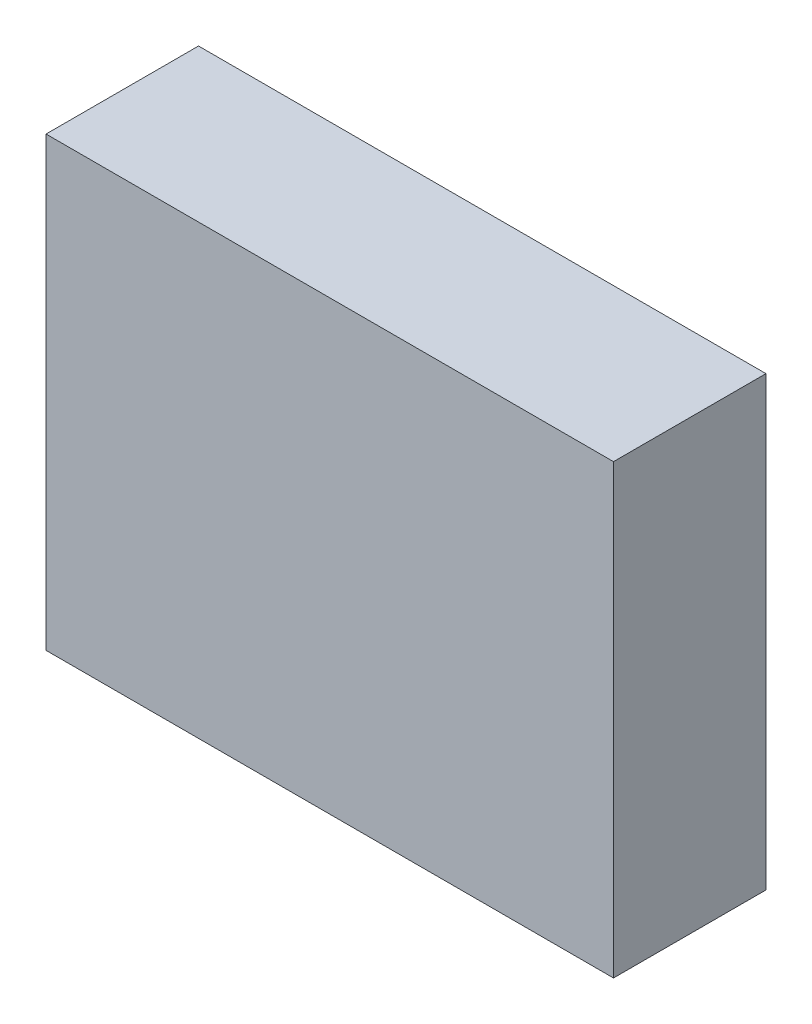
ISO-10303-21;
HEADER;
FILE_DESCRIPTION(('STEP AP214'),'2;1');
FILE_NAME('part.step','',(''),(''),'','','');
FILE_SCHEMA(('AUTOMOTIVE_DESIGN { 1 0 10303 214 1 1 1 1 }'));
ENDSEC;
DATA;
#1=APPLICATION_CONTEXT('core data for automotive mechanical design processes');
#2=APPLICATION_PROTOCOL_DEFINITION('international standard','automotive_design',2000,#1);
#3=PRODUCT_CONTEXT('',#1,'mechanical');
#4=PRODUCT('Part','Part','',(#3));
#5=PRODUCT_RELATED_PRODUCT_CATEGORY('part','',(#4));
#6=PRODUCT_DEFINITION_FORMATION('','',#4);
#7=PRODUCT_DEFINITION_CONTEXT('part definition',#1,'design');
#8=PRODUCT_DEFINITION('design','',#6,#7);
#9=PRODUCT_DEFINITION_SHAPE('','',#8);
#10=(LENGTH_UNIT() NAMED_UNIT(*) SI_UNIT(.MILLI.,.METRE.));
#11=(NAMED_UNIT(*) PLANE_ANGLE_UNIT() SI_UNIT($,.RADIAN.));
#12=(NAMED_UNIT(*) SI_UNIT($,.STERADIAN.) SOLID_ANGLE_UNIT());
#13=UNCERTAINTY_MEASURE_WITH_UNIT(LENGTH_MEASURE(1.E-05),#10,'distance_accuracy_value','');
#14=(GEOMETRIC_REPRESENTATION_CONTEXT(3) GLOBAL_UNCERTAINTY_ASSIGNED_CONTEXT((#13)) GLOBAL_UNIT_ASSIGNED_CONTEXT((#10,
#11,#12)) REPRESENTATION_CONTEXT('',''));
#15=CARTESIAN_POINT('',(0.,0.,0.));
#16=DIRECTION('',(0.,0.,1.));
#17=DIRECTION('',(1.,0.,0.));
#18=AXIS2_PLACEMENT_3D('',#15,#16,#17);
#19=CARTESIAN_POINT('',(1.67500046,1.3199999,0.90000074));
#20=DIRECTION('',(0.,0.,-1.));
#21=DIRECTION('',(-1.,0.,0.));
#22=AXIS2_PLACEMENT_3D('',#19,#20,#21);
#23=PLANE('',#22);
#24=DIRECTION('',(0.,1.,0.));
#25=VECTOR('',#24,1.);
#26=CARTESIAN_POINT('',(-1.67500046,1.3199999,0.90000074));
#27=LINE('',#26,#25);
#28=CARTESIAN_POINT('',(-1.67500046,1.3199999,0.90000074));
#29=VERTEX_POINT('',#28);
#30=CARTESIAN_POINT('',(-1.67500046,-1.3199999,0.90000074));
#31=VERTEX_POINT('',#30);
#32=EDGE_CURVE('E55',#29,#31,#27,.F.);
#33=ORIENTED_EDGE('',*,*,#32,.T.);
#34=DIRECTION('',(1.,0.,0.));
#35=VECTOR('',#34,1.);
#36=CARTESIAN_POINT('',(-1.67500046,-1.3199999,0.90000074));
#37=LINE('',#36,#35);
#38=CARTESIAN_POINT('',(1.67500046,-1.3199999,0.90000074));
#39=VERTEX_POINT('',#38);
#40=EDGE_CURVE('E57',#31,#39,#37,.T.);
#41=ORIENTED_EDGE('',*,*,#40,.T.);
#42=DIRECTION('',(0.,1.,0.));
#43=VECTOR('',#42,1.);
#44=CARTESIAN_POINT('',(1.67500046,-1.3199999,0.90000074));
#45=LINE('',#44,#43);
#46=CARTESIAN_POINT('',(1.67500046,1.3199999,0.90000074));
#47=VERTEX_POINT('',#46);
#48=EDGE_CURVE('E19',#39,#47,#45,.T.);
#49=ORIENTED_EDGE('',*,*,#48,.T.);
#50=DIRECTION('',(1.,0.,0.));
#51=VECTOR('',#50,1.);
#52=CARTESIAN_POINT('',(1.67500046,1.3199999,0.90000074));
#53=LINE('',#52,#51);
#54=EDGE_CURVE('E87',#47,#29,#53,.F.);
#55=ORIENTED_EDGE('',*,*,#54,.T.);
#56=EDGE_LOOP('',(#33,#41,#49,#55));
#57=FACE_BOUND('',#56,.T.);
#58=ADVANCED_FACE('F16',(#57),#23,.F.);
#59=CARTESIAN_POINT('',(1.67500046,-1.3199999,0.));
#60=DIRECTION('',(-1.,0.,0.));
#61=DIRECTION('',(0.,0.,1.));
#62=AXIS2_PLACEMENT_3D('',#59,#60,#61);
#63=PLANE('',#62);
#64=DIRECTION('',(0.,0.,-1.));
#65=VECTOR('',#64,1.);
#66=CARTESIAN_POINT('',(1.67500046,1.3199999,0.));
#67=LINE('',#66,#65);
#68=CARTESIAN_POINT('',(1.67500046,1.3199999,0.));
#69=VERTEX_POINT('',#68);
#70=EDGE_CURVE('E69',#69,#47,#67,.F.);
#71=ORIENTED_EDGE('',*,*,#70,.T.);
#72=ORIENTED_EDGE('',*,*,#48,.F.);
#73=DIRECTION('',(0.,0.,1.));
#74=VECTOR('',#73,1.);
#75=CARTESIAN_POINT('',(1.67500046,-1.3199999,0.));
#76=LINE('',#75,#74);
#77=CARTESIAN_POINT('',(1.67500046,-1.3199999,0.));
#78=VERTEX_POINT('',#77);
#79=EDGE_CURVE('E64',#39,#78,#76,.F.);
#80=ORIENTED_EDGE('',*,*,#79,.T.);
#81=DIRECTION('',(0.,1.,0.));
#82=VECTOR('',#81,1.);
#83=CARTESIAN_POINT('',(1.67500046,1.3199999,0.));
#84=LINE('',#83,#82);
#85=EDGE_CURVE('E92',#69,#78,#84,.F.);
#86=ORIENTED_EDGE('',*,*,#85,.F.);
#87=EDGE_LOOP('',(#71,#72,#80,#86));
#88=FACE_BOUND('',#87,.T.);
#89=ADVANCED_FACE('F66',(#88),#63,.F.);
#90=CARTESIAN_POINT('',(-1.67500046,-1.3199999,0.));
#91=DIRECTION('',(0.,1.,0.));
#92=DIRECTION('',(0.,0.,1.));
#93=AXIS2_PLACEMENT_3D('',#90,#91,#92);
#94=PLANE('',#93);
#95=ORIENTED_EDGE('',*,*,#79,.F.);
#96=ORIENTED_EDGE('',*,*,#40,.F.);
#97=DIRECTION('',(0.,0.,-1.));
#98=VECTOR('',#97,1.);
#99=CARTESIAN_POINT('',(-1.67500046,-1.3199999,0.));
#100=LINE('',#99,#98);
#101=CARTESIAN_POINT('',(-1.67500046,-1.3199999,0.));
#102=VERTEX_POINT('',#101);
#103=EDGE_CURVE('E80',#31,#102,#100,.T.);
#104=ORIENTED_EDGE('',*,*,#103,.T.);
#105=DIRECTION('',(-1.,0.,0.));
#106=VECTOR('',#105,1.);
#107=CARTESIAN_POINT('',(1.67500046,-1.3199999,0.));
#108=LINE('',#107,#106);
#109=EDGE_CURVE('E74',#78,#102,#108,.T.);
#110=ORIENTED_EDGE('',*,*,#109,.F.);
#111=EDGE_LOOP('',(#95,#96,#104,#110));
#112=FACE_BOUND('',#111,.T.);
#113=ADVANCED_FACE('F72',(#112),#94,.F.);
#114=CARTESIAN_POINT('',(-1.67500046,1.3199999,0.));
#115=DIRECTION('',(1.,0.,0.));
#116=DIRECTION('',(0.,0.,-1.));
#117=AXIS2_PLACEMENT_3D('',#114,#115,#116);
#118=PLANE('',#117);
#119=ORIENTED_EDGE('',*,*,#103,.F.);
#120=ORIENTED_EDGE('',*,*,#32,.F.);
#121=DIRECTION('',(0.,0.,-1.));
#122=VECTOR('',#121,1.);
#123=CARTESIAN_POINT('',(-1.67500046,1.3199999,0.));
#124=LINE('',#123,#122);
#125=CARTESIAN_POINT('',(-1.67500046,1.3199999,0.));
#126=VERTEX_POINT('',#125);
#127=EDGE_CURVE('E35',#29,#126,#124,.T.);
#128=ORIENTED_EDGE('',*,*,#127,.T.);
#129=DIRECTION('',(0.,1.,0.));
#130=VECTOR('',#129,1.);
#131=CARTESIAN_POINT('',(-1.67500046,1.3199999,0.));
#132=LINE('',#131,#130);
#133=EDGE_CURVE('E26',#102,#126,#132,.T.);
#134=ORIENTED_EDGE('',*,*,#133,.F.);
#135=EDGE_LOOP('',(#119,#120,#128,#134));
#136=FACE_BOUND('',#135,.T.);
#137=ADVANCED_FACE('F101',(#136),#118,.F.);
#138=CARTESIAN_POINT('',(1.67500046,1.3199999,0.));
#139=DIRECTION('',(0.,-1.,0.));
#140=DIRECTION('',(0.,0.,-1.));
#141=AXIS2_PLACEMENT_3D('',#138,#139,#140);
#142=PLANE('',#141);
#143=ORIENTED_EDGE('',*,*,#127,.F.);
#144=ORIENTED_EDGE('',*,*,#54,.F.);
#145=ORIENTED_EDGE('',*,*,#70,.F.);
#146=DIRECTION('',(-1.,0.,0.));
#147=VECTOR('',#146,1.);
#148=CARTESIAN_POINT('',(1.67500046,1.3199999,0.));
#149=LINE('',#148,#147);
#150=EDGE_CURVE('E10',#126,#69,#149,.F.);
#151=ORIENTED_EDGE('',*,*,#150,.F.);
#152=EDGE_LOOP('',(#143,#144,#145,#151));
#153=FACE_BOUND('',#152,.T.);
#154=ADVANCED_FACE('F103',(#153),#142,.F.);
#155=CARTESIAN_POINT('',(1.67500046,1.3199999,0.));
#156=DIRECTION('',(0.,0.,-1.));
#157=DIRECTION('',(-1.,0.,0.));
#158=AXIS2_PLACEMENT_3D('',#155,#156,#157);
#159=PLANE('',#158);
#160=ORIENTED_EDGE('',*,*,#133,.T.);
#161=ORIENTED_EDGE('',*,*,#150,.T.);
#162=ORIENTED_EDGE('',*,*,#85,.T.);
#163=ORIENTED_EDGE('',*,*,#109,.T.);
#164=EDGE_LOOP('',(#160,#161,#162,#163));
#165=FACE_BOUND('',#164,.T.);
#166=ADVANCED_FACE('F100',(#165),#159,.T.);
#167=CLOSED_SHELL('',(#58,#89,#113,#137,#154,#166));
#168=MANIFOLD_SOLID_BREP('B1',#167);
#169=ADVANCED_BREP_SHAPE_REPRESENTATION('',(#18,#168),#14);
#170=SHAPE_DEFINITION_REPRESENTATION(#9,#169);
ENDSEC;
END-ISO-10303-21;
